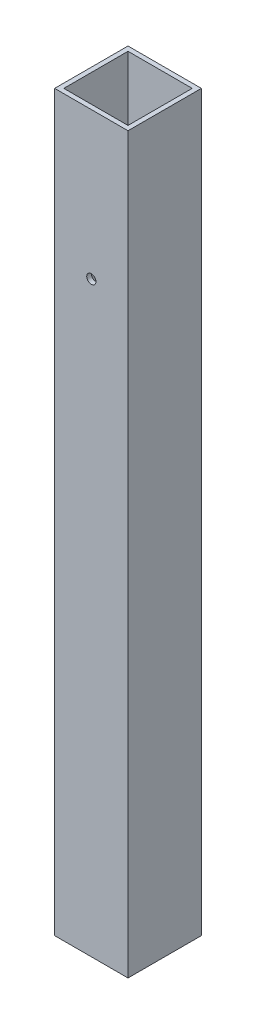
ISO-10303-21;
HEADER;
FILE_DESCRIPTION(('STEP AP214'),'2;1');
FILE_NAME('part.step','',(''),(''),'','','');
FILE_SCHEMA(('AUTOMOTIVE_DESIGN { 1 0 10303 214 1 1 1 1 }'));
ENDSEC;
DATA;
#1=APPLICATION_CONTEXT('core data for automotive mechanical design processes');
#2=APPLICATION_PROTOCOL_DEFINITION('international standard','automotive_design',2000,#1);
#3=PRODUCT_CONTEXT('',#1,'mechanical');
#4=PRODUCT('Part','Part','',(#3));
#5=PRODUCT_RELATED_PRODUCT_CATEGORY('part','',(#4));
#6=PRODUCT_DEFINITION_FORMATION('','',#4);
#7=PRODUCT_DEFINITION_CONTEXT('part definition',#1,'design');
#8=PRODUCT_DEFINITION('design','',#6,#7);
#9=PRODUCT_DEFINITION_SHAPE('','',#8);
#10=(LENGTH_UNIT() NAMED_UNIT(*) SI_UNIT(.MILLI.,.METRE.));
#11=(NAMED_UNIT(*) PLANE_ANGLE_UNIT() SI_UNIT($,.RADIAN.));
#12=(NAMED_UNIT(*) SI_UNIT($,.STERADIAN.) SOLID_ANGLE_UNIT());
#13=UNCERTAINTY_MEASURE_WITH_UNIT(LENGTH_MEASURE(1.E-05),#10,'distance_accuracy_value','');
#14=(GEOMETRIC_REPRESENTATION_CONTEXT(3) GLOBAL_UNCERTAINTY_ASSIGNED_CONTEXT((#13)) GLOBAL_UNIT_ASSIGNED_CONTEXT((#10,
#11,#12)) REPRESENTATION_CONTEXT('',''));
#15=CARTESIAN_POINT('',(0.,0.,0.));
#16=DIRECTION('',(0.,0.,1.));
#17=DIRECTION('',(1.,0.,0.));
#18=AXIS2_PLACEMENT_3D('',#15,#16,#17);
#19=CARTESIAN_POINT('',(0.,254.,0.));
#20=DIRECTION('',(0.,1.,0.));
#21=DIRECTION('',(0.,0.,1.));
#22=AXIS2_PLACEMENT_3D('',#19,#20,#21);
#23=PLANE('',#22);
#24=DIRECTION('',(0.,0.,1.));
#25=VECTOR('',#24,1.);
#26=CARTESIAN_POINT('',(-12.7,254.,12.7));
#27=LINE('',#26,#25);
#28=CARTESIAN_POINT('',(-12.7,254.,-12.7));
#29=VERTEX_POINT('',#28);
#30=CARTESIAN_POINT('',(-12.7,254.,12.7));
#31=VERTEX_POINT('',#30);
#32=EDGE_CURVE('E137',#29,#31,#27,.T.);
#33=ORIENTED_EDGE('',*,*,#32,.T.);
#34=DIRECTION('',(1.,0.,0.));
#35=VECTOR('',#34,1.);
#36=CARTESIAN_POINT('',(12.7,254.,12.7));
#37=LINE('',#36,#35);
#38=CARTESIAN_POINT('',(12.7,254.,12.7));
#39=VERTEX_POINT('',#38);
#40=EDGE_CURVE('E140',#31,#39,#37,.T.);
#41=ORIENTED_EDGE('',*,*,#40,.T.);
#42=DIRECTION('',(0.,0.,-1.));
#43=VECTOR('',#42,1.);
#44=CARTESIAN_POINT('',(12.7,254.,12.7));
#45=LINE('',#44,#43);
#46=CARTESIAN_POINT('',(12.7,254.,-12.7));
#47=VERTEX_POINT('',#46);
#48=EDGE_CURVE('E143',#39,#47,#45,.T.);
#49=ORIENTED_EDGE('',*,*,#48,.T.);
#50=DIRECTION('',(-1.,0.,0.));
#51=VECTOR('',#50,1.);
#52=CARTESIAN_POINT('',(12.7,254.,-12.7));
#53=LINE('',#52,#51);
#54=EDGE_CURVE('E145',#47,#29,#53,.T.);
#55=ORIENTED_EDGE('',*,*,#54,.T.);
#56=EDGE_LOOP('',(#33,#41,#49,#55));
#57=FACE_BOUND('',#56,.T.);
#58=DIRECTION('',(0.,0.,-1.));
#59=VECTOR('',#58,1.);
#60=CARTESIAN_POINT('',(11.1125,254.,11.1125));
#61=LINE('',#60,#59);
#62=CARTESIAN_POINT('',(11.1125,254.,11.1125));
#63=VERTEX_POINT('',#62);
#64=CARTESIAN_POINT('',(11.1125,254.,-11.1125));
#65=VERTEX_POINT('',#64);
#66=EDGE_CURVE('E107',#63,#65,#61,.T.);
#67=ORIENTED_EDGE('',*,*,#66,.F.);
#68=DIRECTION('',(1.,0.,0.));
#69=VECTOR('',#68,1.);
#70=CARTESIAN_POINT('',(11.1125,254.,11.1125));
#71=LINE('',#70,#69);
#72=CARTESIAN_POINT('',(-11.1125,254.,11.1125));
#73=VERTEX_POINT('',#72);
#74=EDGE_CURVE('E99',#73,#63,#71,.T.);
#75=ORIENTED_EDGE('',*,*,#74,.F.);
#76=DIRECTION('',(0.,0.,1.));
#77=VECTOR('',#76,1.);
#78=CARTESIAN_POINT('',(-11.1125,254.,11.1125));
#79=LINE('',#78,#77);
#80=CARTESIAN_POINT('',(-11.1125,254.,-11.1125));
#81=VERTEX_POINT('',#80);
#82=EDGE_CURVE('E121',#81,#73,#79,.T.);
#83=ORIENTED_EDGE('',*,*,#82,.F.);
#84=DIRECTION('',(-1.,0.,0.));
#85=VECTOR('',#84,1.);
#86=CARTESIAN_POINT('',(11.1125,254.,-11.1125));
#87=LINE('',#86,#85);
#88=EDGE_CURVE('E119',#65,#81,#87,.T.);
#89=ORIENTED_EDGE('',*,*,#88,.F.);
#90=EDGE_LOOP('',(#67,#75,#83,#89));
#91=FACE_BOUND('',#90,.T.);
#92=ADVANCED_FACE('F33',(#57,#91),#23,.T.);
#93=CARTESIAN_POINT('',(0.,0.,0.));
#94=DIRECTION('',(0.,1.,0.));
#95=DIRECTION('',(0.,0.,1.));
#96=AXIS2_PLACEMENT_3D('',#93,#94,#95);
#97=PLANE('',#96);
#98=DIRECTION('',(0.,0.,1.));
#99=VECTOR('',#98,1.);
#100=CARTESIAN_POINT('',(-12.7,0.,12.7));
#101=LINE('',#100,#99);
#102=CARTESIAN_POINT('',(-12.7,0.,-12.7));
#103=VERTEX_POINT('',#102);
#104=CARTESIAN_POINT('',(-12.7,0.,12.7));
#105=VERTEX_POINT('',#104);
#106=EDGE_CURVE('E115',#103,#105,#101,.T.);
#107=ORIENTED_EDGE('',*,*,#106,.F.);
#108=DIRECTION('',(-1.,0.,0.));
#109=VECTOR('',#108,1.);
#110=CARTESIAN_POINT('',(12.7,0.,-12.7));
#111=LINE('',#110,#109);
#112=CARTESIAN_POINT('',(12.7,0.,-12.7));
#113=VERTEX_POINT('',#112);
#114=EDGE_CURVE('E141',#113,#103,#111,.T.);
#115=ORIENTED_EDGE('',*,*,#114,.F.);
#116=DIRECTION('',(0.,0.,-1.));
#117=VECTOR('',#116,1.);
#118=CARTESIAN_POINT('',(12.7,0.,12.7));
#119=LINE('',#118,#117);
#120=CARTESIAN_POINT('',(12.7,0.,12.7));
#121=VERTEX_POINT('',#120);
#122=EDGE_CURVE('E152',#121,#113,#119,.T.);
#123=ORIENTED_EDGE('',*,*,#122,.F.);
#124=DIRECTION('',(1.,0.,0.));
#125=VECTOR('',#124,1.);
#126=CARTESIAN_POINT('',(12.7,0.,12.7));
#127=LINE('',#126,#125);
#128=EDGE_CURVE('E150',#105,#121,#127,.T.);
#129=ORIENTED_EDGE('',*,*,#128,.F.);
#130=EDGE_LOOP('',(#107,#115,#123,#129));
#131=FACE_BOUND('',#130,.T.);
#132=DIRECTION('',(1.,0.,0.));
#133=VECTOR('',#132,1.);
#134=CARTESIAN_POINT('',(11.1125,0.,11.1125));
#135=LINE('',#134,#133);
#136=CARTESIAN_POINT('',(-11.1125,0.,11.1125));
#137=VERTEX_POINT('',#136);
#138=CARTESIAN_POINT('',(11.1125,0.,11.1125));
#139=VERTEX_POINT('',#138);
#140=EDGE_CURVE('E57',#137,#139,#135,.T.);
#141=ORIENTED_EDGE('',*,*,#140,.T.);
#142=DIRECTION('',(0.,0.,-1.));
#143=VECTOR('',#142,1.);
#144=CARTESIAN_POINT('',(11.1125,0.,11.1125));
#145=LINE('',#144,#143);
#146=CARTESIAN_POINT('',(11.1125,0.,-11.1125));
#147=VERTEX_POINT('',#146);
#148=EDGE_CURVE('E114',#139,#147,#145,.T.);
#149=ORIENTED_EDGE('',*,*,#148,.T.);
#150=DIRECTION('',(-1.,0.,0.));
#151=VECTOR('',#150,1.);
#152=CARTESIAN_POINT('',(11.1125,0.,-11.1125));
#153=LINE('',#152,#151);
#154=CARTESIAN_POINT('',(-11.1125,0.,-11.1125));
#155=VERTEX_POINT('',#154);
#156=EDGE_CURVE('E129',#147,#155,#153,.T.);
#157=ORIENTED_EDGE('',*,*,#156,.T.);
#158=DIRECTION('',(0.,0.,1.));
#159=VECTOR('',#158,1.);
#160=CARTESIAN_POINT('',(-11.1125,0.,11.1125));
#161=LINE('',#160,#159);
#162=EDGE_CURVE('E108',#155,#137,#161,.T.);
#163=ORIENTED_EDGE('',*,*,#162,.T.);
#164=EDGE_LOOP('',(#141,#149,#157,#163));
#165=FACE_BOUND('',#164,.T.);
#166=ADVANCED_FACE('F171',(#131,#165),#97,.F.);
#167=CARTESIAN_POINT('',(-12.7,254.,12.7));
#168=DIRECTION('',(1.,0.,0.));
#169=DIRECTION('',(0.,0.,-1.));
#170=AXIS2_PLACEMENT_3D('',#167,#168,#169);
#171=PLANE('',#170);
#172=ORIENTED_EDGE('',*,*,#106,.T.);
#173=DIRECTION('',(0.,-1.,0.));
#174=VECTOR('',#173,1.);
#175=CARTESIAN_POINT('',(-12.7,254.,12.7));
#176=LINE('',#175,#174);
#177=EDGE_CURVE('E11',#31,#105,#176,.T.);
#178=ORIENTED_EDGE('',*,*,#177,.F.);
#179=ORIENTED_EDGE('',*,*,#32,.F.);
#180=DIRECTION('',(0.,-1.,0.));
#181=VECTOR('',#180,1.);
#182=CARTESIAN_POINT('',(-12.7,254.,-12.7));
#183=LINE('',#182,#181);
#184=EDGE_CURVE('E147',#29,#103,#183,.T.);
#185=ORIENTED_EDGE('',*,*,#184,.T.);
#186=EDGE_LOOP('',(#172,#178,#179,#185));
#187=FACE_BOUND('',#186,.T.);
#188=ADVANCED_FACE('F35',(#187),#171,.F.);
#189=CARTESIAN_POINT('',(12.7,254.,12.7));
#190=DIRECTION('',(0.,0.,-1.));
#191=DIRECTION('',(-1.,0.,0.));
#192=AXIS2_PLACEMENT_3D('',#189,#190,#191);
#193=PLANE('',#192);
#194=CARTESIAN_POINT('',(0.,203.2,12.7));
#195=DIRECTION('',(0.,0.,1.));
#196=DIRECTION('',(1.,0.,0.));
#197=AXIS2_PLACEMENT_3D('',#194,#195,#196);
#198=CIRCLE('',#197,1.5875);
#199=CARTESIAN_POINT('',(1.5875,203.2,12.7));
#200=VERTEX_POINT('',#199);
#201=EDGE_CURVE('E209',#200,#200,#198,.T.);
#202=ORIENTED_EDGE('',*,*,#201,.F.);
#203=EDGE_LOOP('',(#202));
#204=FACE_BOUND('',#203,.T.);
#205=ORIENTED_EDGE('',*,*,#128,.T.);
#206=DIRECTION('',(0.,-1.,0.));
#207=VECTOR('',#206,1.);
#208=CARTESIAN_POINT('',(12.7,254.,12.7));
#209=LINE('',#208,#207);
#210=EDGE_CURVE('E42',#39,#121,#209,.T.);
#211=ORIENTED_EDGE('',*,*,#210,.F.);
#212=ORIENTED_EDGE('',*,*,#40,.F.);
#213=ORIENTED_EDGE('',*,*,#177,.T.);
#214=EDGE_LOOP('',(#205,#211,#212,#213));
#215=FACE_BOUND('',#214,.T.);
#216=ADVANCED_FACE('F181',(#204,#215),#193,.F.);
#217=CARTESIAN_POINT('',(12.7,254.,12.7));
#218=DIRECTION('',(-1.,0.,0.));
#219=DIRECTION('',(0.,0.,1.));
#220=AXIS2_PLACEMENT_3D('',#217,#218,#219);
#221=PLANE('',#220);
#222=ORIENTED_EDGE('',*,*,#122,.T.);
#223=DIRECTION('',(0.,-1.,0.));
#224=VECTOR('',#223,1.);
#225=CARTESIAN_POINT('',(12.7,254.,-12.7));
#226=LINE('',#225,#224);
#227=EDGE_CURVE('E157',#47,#113,#226,.T.);
#228=ORIENTED_EDGE('',*,*,#227,.F.);
#229=ORIENTED_EDGE('',*,*,#48,.F.);
#230=ORIENTED_EDGE('',*,*,#210,.T.);
#231=EDGE_LOOP('',(#222,#228,#229,#230));
#232=FACE_BOUND('',#231,.T.);
#233=ADVANCED_FACE('F165',(#232),#221,.F.);
#234=CARTESIAN_POINT('',(12.7,254.,-12.7));
#235=DIRECTION('',(0.,0.,1.));
#236=DIRECTION('',(1.,0.,0.));
#237=AXIS2_PLACEMENT_3D('',#234,#235,#236);
#238=PLANE('',#237);
#239=CARTESIAN_POINT('',(0.,203.2,-12.7));
#240=DIRECTION('',(0.,0.,1.));
#241=DIRECTION('',(1.,0.,0.));
#242=AXIS2_PLACEMENT_3D('',#239,#240,#241);
#243=CIRCLE('',#242,1.5875);
#244=CARTESIAN_POINT('',(1.5875,203.2,-12.7));
#245=VERTEX_POINT('',#244);
#246=EDGE_CURVE('E207',#245,#245,#243,.T.);
#247=ORIENTED_EDGE('',*,*,#246,.T.);
#248=EDGE_LOOP('',(#247));
#249=FACE_BOUND('',#248,.T.);
#250=ORIENTED_EDGE('',*,*,#114,.T.);
#251=ORIENTED_EDGE('',*,*,#184,.F.);
#252=ORIENTED_EDGE('',*,*,#54,.F.);
#253=ORIENTED_EDGE('',*,*,#227,.T.);
#254=EDGE_LOOP('',(#250,#251,#252,#253));
#255=FACE_BOUND('',#254,.T.);
#256=ADVANCED_FACE('F175',(#249,#255),#238,.F.);
#257=CARTESIAN_POINT('',(11.1125,254.,11.1125));
#258=DIRECTION('',(0.,0.,-1.));
#259=DIRECTION('',(-1.,0.,0.));
#260=AXIS2_PLACEMENT_3D('',#257,#258,#259);
#261=PLANE('',#260);
#262=CARTESIAN_POINT('',(0.,203.2,11.1125));
#263=DIRECTION('',(0.,0.,-1.));
#264=DIRECTION('',(-1.,0.,0.));
#265=AXIS2_PLACEMENT_3D('',#262,#263,#264);
#266=CIRCLE('',#265,1.5875);
#267=CARTESIAN_POINT('',(-1.5875,203.2,11.1125));
#268=VERTEX_POINT('',#267);
#269=EDGE_CURVE('E127',#268,#268,#266,.T.);
#270=ORIENTED_EDGE('',*,*,#269,.F.);
#271=EDGE_LOOP('',(#270));
#272=FACE_BOUND('',#271,.T.);
#273=ORIENTED_EDGE('',*,*,#140,.F.);
#274=DIRECTION('',(0.,-1.,0.));
#275=VECTOR('',#274,1.);
#276=CARTESIAN_POINT('',(-11.1125,254.,11.1125));
#277=LINE('',#276,#275);
#278=EDGE_CURVE('E103',#73,#137,#277,.T.);
#279=ORIENTED_EDGE('',*,*,#278,.F.);
#280=ORIENTED_EDGE('',*,*,#74,.T.);
#281=DIRECTION('',(0.,-1.,0.));
#282=VECTOR('',#281,1.);
#283=CARTESIAN_POINT('',(11.1125,254.,11.1125));
#284=LINE('',#283,#282);
#285=EDGE_CURVE('E102',#63,#139,#284,.T.);
#286=ORIENTED_EDGE('',*,*,#285,.T.);
#287=EDGE_LOOP('',(#273,#279,#280,#286));
#288=FACE_BOUND('',#287,.T.);
#289=ADVANCED_FACE('F101',(#272,#288),#261,.T.);
#290=CARTESIAN_POINT('',(11.1125,254.,11.1125));
#291=DIRECTION('',(-1.,0.,0.));
#292=DIRECTION('',(0.,0.,1.));
#293=AXIS2_PLACEMENT_3D('',#290,#291,#292);
#294=PLANE('',#293);
#295=ORIENTED_EDGE('',*,*,#148,.F.);
#296=ORIENTED_EDGE('',*,*,#285,.F.);
#297=ORIENTED_EDGE('',*,*,#66,.T.);
#298=DIRECTION('',(0.,-1.,0.));
#299=VECTOR('',#298,1.);
#300=CARTESIAN_POINT('',(11.1125,254.,-11.1125));
#301=LINE('',#300,#299);
#302=EDGE_CURVE('E116',#65,#147,#301,.T.);
#303=ORIENTED_EDGE('',*,*,#302,.T.);
#304=EDGE_LOOP('',(#295,#296,#297,#303));
#305=FACE_BOUND('',#304,.T.);
#306=ADVANCED_FACE('F111',(#305),#294,.T.);
#307=CARTESIAN_POINT('',(11.1125,254.,-11.1125));
#308=DIRECTION('',(0.,0.,1.));
#309=DIRECTION('',(1.,0.,0.));
#310=AXIS2_PLACEMENT_3D('',#307,#308,#309);
#311=PLANE('',#310);
#312=CARTESIAN_POINT('',(0.,203.2,-11.1125));
#313=DIRECTION('',(0.,0.,1.));
#314=DIRECTION('',(1.,0.,0.));
#315=AXIS2_PLACEMENT_3D('',#312,#313,#314);
#316=CIRCLE('',#315,1.5875);
#317=CARTESIAN_POINT('',(1.5875,203.2,-11.1125));
#318=VERTEX_POINT('',#317);
#319=EDGE_CURVE('E37',#318,#318,#316,.T.);
#320=ORIENTED_EDGE('',*,*,#319,.F.);
#321=EDGE_LOOP('',(#320));
#322=FACE_BOUND('',#321,.T.);
#323=ORIENTED_EDGE('',*,*,#156,.F.);
#324=ORIENTED_EDGE('',*,*,#302,.F.);
#325=ORIENTED_EDGE('',*,*,#88,.T.);
#326=DIRECTION('',(0.,-1.,0.));
#327=VECTOR('',#326,1.);
#328=CARTESIAN_POINT('',(-11.1125,254.,-11.1125));
#329=LINE('',#328,#327);
#330=EDGE_CURVE('E49',#81,#155,#329,.T.);
#331=ORIENTED_EDGE('',*,*,#330,.T.);
#332=EDGE_LOOP('',(#323,#324,#325,#331));
#333=FACE_BOUND('',#332,.T.);
#334=ADVANCED_FACE('F230',(#322,#333),#311,.T.);
#335=CARTESIAN_POINT('',(-11.1125,254.,11.1125));
#336=DIRECTION('',(1.,0.,0.));
#337=DIRECTION('',(0.,0.,-1.));
#338=AXIS2_PLACEMENT_3D('',#335,#336,#337);
#339=PLANE('',#338);
#340=ORIENTED_EDGE('',*,*,#162,.F.);
#341=ORIENTED_EDGE('',*,*,#330,.F.);
#342=ORIENTED_EDGE('',*,*,#82,.T.);
#343=ORIENTED_EDGE('',*,*,#278,.T.);
#344=EDGE_LOOP('',(#340,#341,#342,#343));
#345=FACE_BOUND('',#344,.T.);
#346=ADVANCED_FACE('F225',(#345),#339,.T.);
#347=CARTESIAN_POINT('',(0.,203.2,-12.7));
#348=DIRECTION('',(0.,0.,1.));
#349=DIRECTION('',(1.,0.,0.));
#350=AXIS2_PLACEMENT_3D('',#347,#348,#349);
#351=CYLINDRICAL_SURFACE('',#350,1.5875);
#352=ORIENTED_EDGE('',*,*,#319,.T.);
#353=EDGE_LOOP('',(#352));
#354=FACE_BOUND('',#353,.T.);
#355=ORIENTED_EDGE('',*,*,#246,.F.);
#356=EDGE_LOOP('',(#355));
#357=FACE_BOUND('',#356,.T.);
#358=ADVANCED_FACE('F220',(#354,#357),#351,.F.);
#359=ORIENTED_EDGE('',*,*,#269,.T.);
#360=EDGE_LOOP('',(#359));
#361=FACE_BOUND('',#360,.T.);
#362=ORIENTED_EDGE('',*,*,#201,.T.);
#363=EDGE_LOOP('',(#362));
#364=FACE_BOUND('',#363,.T.);
#365=ADVANCED_FACE('F217',(#361,#364),#351,.F.);
#366=CLOSED_SHELL('',(#92,#166,#188,#216,#233,#256,#289,#306,#334,#346,#358,#365));
#367=MANIFOLD_SOLID_BREP('B2',#366);
#368=ADVANCED_BREP_SHAPE_REPRESENTATION('',(#18,#367),#14);
#369=SHAPE_DEFINITION_REPRESENTATION(#9,#368);
ENDSEC;
END-ISO-10303-21;
